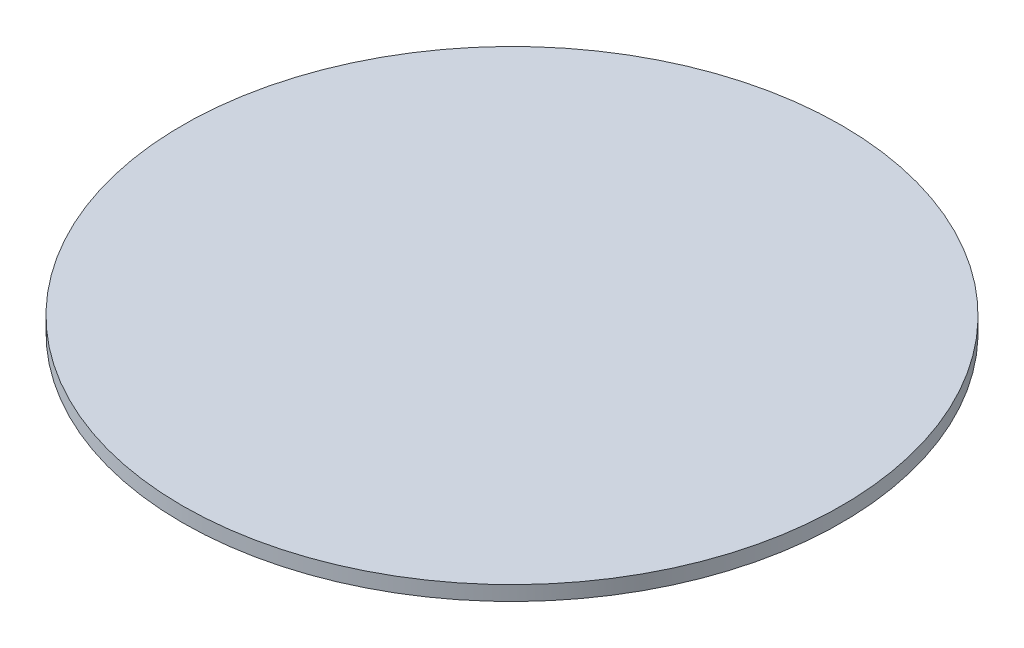
ISO-10303-21;
HEADER;
FILE_DESCRIPTION(('STEP AP214'),'2;1');
FILE_NAME('part.step','',(''),(''),'','','');
FILE_SCHEMA(('AUTOMOTIVE_DESIGN { 1 0 10303 214 1 1 1 1 }'));
ENDSEC;
DATA;
#1=APPLICATION_CONTEXT('core data for automotive mechanical design processes');
#2=APPLICATION_PROTOCOL_DEFINITION('international standard','automotive_design',2000,#1);
#3=PRODUCT_CONTEXT('',#1,'mechanical');
#4=PRODUCT('Part','Part','',(#3));
#5=PRODUCT_RELATED_PRODUCT_CATEGORY('part','',(#4));
#6=PRODUCT_DEFINITION_FORMATION('','',#4);
#7=PRODUCT_DEFINITION_CONTEXT('part definition',#1,'design');
#8=PRODUCT_DEFINITION('design','',#6,#7);
#9=PRODUCT_DEFINITION_SHAPE('','',#8);
#10=(LENGTH_UNIT() NAMED_UNIT(*) SI_UNIT(.MILLI.,.METRE.));
#11=(NAMED_UNIT(*) PLANE_ANGLE_UNIT() SI_UNIT($,.RADIAN.));
#12=(NAMED_UNIT(*) SI_UNIT($,.STERADIAN.) SOLID_ANGLE_UNIT());
#13=UNCERTAINTY_MEASURE_WITH_UNIT(LENGTH_MEASURE(1.E-05),#10,'distance_accuracy_value','');
#14=(GEOMETRIC_REPRESENTATION_CONTEXT(3) GLOBAL_UNCERTAINTY_ASSIGNED_CONTEXT((#13)) GLOBAL_UNIT_ASSIGNED_CONTEXT((#10,
#11,#12)) REPRESENTATION_CONTEXT('',''));
#15=CARTESIAN_POINT('',(0.,0.,0.));
#16=DIRECTION('',(0.,0.,1.));
#17=DIRECTION('',(1.,0.,0.));
#18=AXIS2_PLACEMENT_3D('',#15,#16,#17);
#19=CARTESIAN_POINT('',(0.,2.,0.));
#20=DIRECTION('',(0.,-1.,0.));
#21=DIRECTION('',(0.,0.,-1.));
#22=AXIS2_PLACEMENT_3D('',#19,#20,#21);
#23=CYLINDRICAL_SURFACE('',#22,45.);
#24=CARTESIAN_POINT('',(0.,2.,0.));
#25=DIRECTION('',(0.,1.,0.));
#26=DIRECTION('',(0.,0.,1.));
#27=AXIS2_PLACEMENT_3D('',#24,#25,#26);
#28=CIRCLE('',#27,45.);
#29=CARTESIAN_POINT('',(0.,2.,45.));
#30=VERTEX_POINT('',#29);
#31=EDGE_CURVE('E10',#30,#30,#28,.T.);
#32=ORIENTED_EDGE('',*,*,#31,.F.);
#33=EDGE_LOOP('',(#32));
#34=FACE_BOUND('',#33,.T.);
#35=CARTESIAN_POINT('',(0.,0.,0.));
#36=DIRECTION('',(0.,1.,0.));
#37=DIRECTION('',(0.,0.,1.));
#38=AXIS2_PLACEMENT_3D('',#35,#36,#37);
#39=CIRCLE('',#38,45.);
#40=CARTESIAN_POINT('',(0.,0.,45.));
#41=VERTEX_POINT('',#40);
#42=EDGE_CURVE('E34',#41,#41,#39,.T.);
#43=ORIENTED_EDGE('',*,*,#42,.T.);
#44=EDGE_LOOP('',(#43));
#45=FACE_BOUND('',#44,.T.);
#46=ADVANCED_FACE('F31',(#34,#45),#23,.T.);
#47=CARTESIAN_POINT('',(0.,2.,0.));
#48=DIRECTION('',(0.,1.,0.));
#49=DIRECTION('',(0.,0.,1.));
#50=AXIS2_PLACEMENT_3D('',#47,#48,#49);
#51=PLANE('',#50);
#52=ORIENTED_EDGE('',*,*,#31,.T.);
#53=EDGE_LOOP('',(#52));
#54=FACE_BOUND('',#53,.T.);
#55=ADVANCED_FACE('F46',(#54),#51,.T.);
#56=CARTESIAN_POINT('',(0.,0.,0.));
#57=DIRECTION('',(0.,1.,0.));
#58=DIRECTION('',(0.,0.,1.));
#59=AXIS2_PLACEMENT_3D('',#56,#57,#58);
#60=PLANE('',#59);
#61=ORIENTED_EDGE('',*,*,#42,.F.);
#62=EDGE_LOOP('',(#61));
#63=FACE_BOUND('',#62,.T.);
#64=ADVANCED_FACE('F44',(#63),#60,.F.);
#65=CLOSED_SHELL('',(#46,#55,#64));
#66=MANIFOLD_SOLID_BREP('B2',#65);
#67=ADVANCED_BREP_SHAPE_REPRESENTATION('',(#18,#66),#14);
#68=SHAPE_DEFINITION_REPRESENTATION(#9,#67);
ENDSEC;
END-ISO-10303-21;
